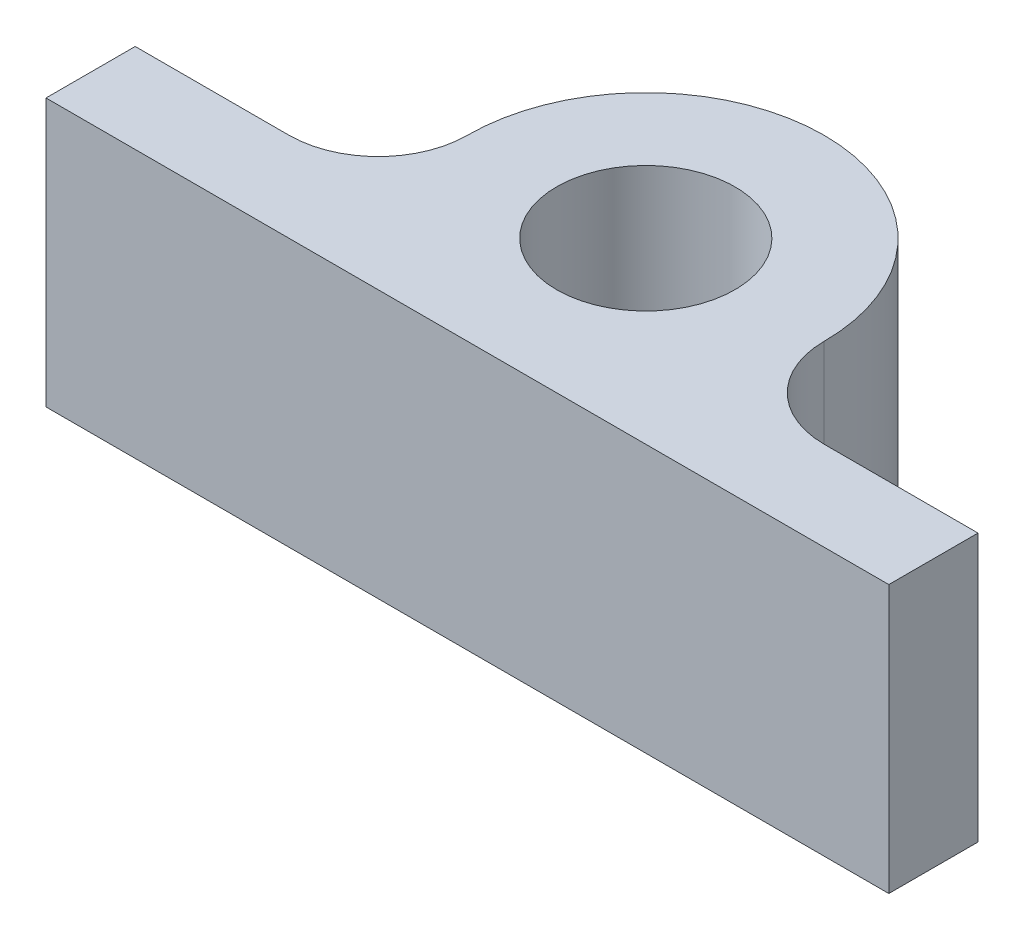
ISO-10303-21;
HEADER;
FILE_DESCRIPTION(('STEP AP214'),'2;1');
FILE_NAME('part.step','',(''),(''),'','','');
FILE_SCHEMA(('AUTOMOTIVE_DESIGN { 1 0 10303 214 1 1 1 1 }'));
ENDSEC;
DATA;
#1=APPLICATION_CONTEXT('core data for automotive mechanical design processes');
#2=APPLICATION_PROTOCOL_DEFINITION('international standard','automotive_design',2000,#1);
#3=PRODUCT_CONTEXT('',#1,'mechanical');
#4=PRODUCT('Part','Part','',(#3));
#5=PRODUCT_RELATED_PRODUCT_CATEGORY('part','',(#4));
#6=PRODUCT_DEFINITION_FORMATION('','',#4);
#7=PRODUCT_DEFINITION_CONTEXT('part definition',#1,'design');
#8=PRODUCT_DEFINITION('design','',#6,#7);
#9=PRODUCT_DEFINITION_SHAPE('','',#8);
#10=(LENGTH_UNIT() NAMED_UNIT(*) SI_UNIT(.MILLI.,.METRE.));
#11=(NAMED_UNIT(*) PLANE_ANGLE_UNIT() SI_UNIT($,.RADIAN.));
#12=(NAMED_UNIT(*) SI_UNIT($,.STERADIAN.) SOLID_ANGLE_UNIT());
#13=UNCERTAINTY_MEASURE_WITH_UNIT(LENGTH_MEASURE(1.E-05),#10,'distance_accuracy_value','');
#14=(GEOMETRIC_REPRESENTATION_CONTEXT(3) GLOBAL_UNCERTAINTY_ASSIGNED_CONTEXT((#13)) GLOBAL_UNIT_ASSIGNED_CONTEXT((#10,
#11,#12)) REPRESENTATION_CONTEXT('',''));
#15=CARTESIAN_POINT('',(0.,0.,0.));
#16=DIRECTION('',(0.,0.,1.));
#17=DIRECTION('',(1.,0.,0.));
#18=AXIS2_PLACEMENT_3D('',#15,#16,#17);
#19=CARTESIAN_POINT('',(38.1,38.1,0.));
#20=DIRECTION('',(0.,-1.,0.));
#21=DIRECTION('',(0.,0.,-1.));
#22=AXIS2_PLACEMENT_3D('',#19,#20,#21);
#23=CYLINDRICAL_SURFACE('',#22,12.7);
#24=CARTESIAN_POINT('',(38.1,0.,0.));
#25=DIRECTION('',(0.,1.,0.));
#26=DIRECTION('',(0.,0.,1.));
#27=AXIS2_PLACEMENT_3D('',#24,#25,#26);
#28=CIRCLE('',#27,12.7);
#29=CARTESIAN_POINT('',(25.4,0.,0.));
#30=VERTEX_POINT('',#29);
#31=CARTESIAN_POINT('',(38.1,0.,12.7));
#32=VERTEX_POINT('',#31);
#33=EDGE_CURVE('E154',#30,#32,#28,.T.);
#34=ORIENTED_EDGE('',*,*,#33,.F.);
#35=DIRECTION('',(0.,-1.,0.));
#36=VECTOR('',#35,1.);
#37=CARTESIAN_POINT('',(25.4,38.1,0.));
#38=LINE('',#37,#36);
#39=CARTESIAN_POINT('',(25.4,38.1,0.));
#40=VERTEX_POINT('',#39);
#41=EDGE_CURVE('E11',#40,#30,#38,.T.);
#42=ORIENTED_EDGE('',*,*,#41,.F.);
#43=CARTESIAN_POINT('',(38.1,38.1,0.));
#44=DIRECTION('',(0.,1.,0.));
#45=DIRECTION('',(0.,0.,1.));
#46=AXIS2_PLACEMENT_3D('',#43,#44,#45);
#47=CIRCLE('',#46,12.7);
#48=CARTESIAN_POINT('',(38.1,38.1,12.7));
#49=VERTEX_POINT('',#48);
#50=EDGE_CURVE('E208',#40,#49,#47,.T.);
#51=ORIENTED_EDGE('',*,*,#50,.T.);
#52=DIRECTION('',(0.,-1.,0.));
#53=VECTOR('',#52,1.);
#54=CARTESIAN_POINT('',(38.1,38.1,12.7));
#55=LINE('',#54,#53);
#56=EDGE_CURVE('E89',#49,#32,#55,.T.);
#57=ORIENTED_EDGE('',*,*,#56,.T.);
#58=EDGE_LOOP('',(#34,#42,#51,#57));
#59=FACE_BOUND('',#58,.T.);
#60=ADVANCED_FACE('F38',(#59),#23,.F.);
#61=CARTESIAN_POINT('',(0.,38.1,0.));
#62=DIRECTION('',(0.,-1.,0.));
#63=DIRECTION('',(0.,0.,-1.));
#64=AXIS2_PLACEMENT_3D('',#61,#62,#63);
#65=CYLINDRICAL_SURFACE('',#64,25.4);
#66=CARTESIAN_POINT('',(0.,0.,0.));
#67=DIRECTION('',(0.,1.,0.));
#68=DIRECTION('',(0.,0.,1.));
#69=AXIS2_PLACEMENT_3D('',#66,#67,#68);
#70=CIRCLE('',#69,25.4);
#71=CARTESIAN_POINT('',(-25.4,0.,0.));
#72=VERTEX_POINT('',#71);
#73=EDGE_CURVE('E152',#30,#72,#70,.T.);
#74=ORIENTED_EDGE('',*,*,#73,.T.);
#75=DIRECTION('',(0.,-1.,0.));
#76=VECTOR('',#75,1.);
#77=CARTESIAN_POINT('',(-25.4,38.1,0.));
#78=LINE('',#77,#76);
#79=CARTESIAN_POINT('',(-25.4,38.1,0.));
#80=VERTEX_POINT('',#79);
#81=EDGE_CURVE('E47',#80,#72,#78,.T.);
#82=ORIENTED_EDGE('',*,*,#81,.F.);
#83=CARTESIAN_POINT('',(0.,38.1,0.));
#84=DIRECTION('',(0.,1.,0.));
#85=DIRECTION('',(0.,0.,1.));
#86=AXIS2_PLACEMENT_3D('',#83,#84,#85);
#87=CIRCLE('',#86,25.4);
#88=EDGE_CURVE('E210',#40,#80,#87,.T.);
#89=ORIENTED_EDGE('',*,*,#88,.F.);
#90=ORIENTED_EDGE('',*,*,#41,.T.);
#91=EDGE_LOOP('',(#74,#82,#89,#90));
#92=FACE_BOUND('',#91,.T.);
#93=ADVANCED_FACE('F153',(#92),#65,.T.);
#94=CARTESIAN_POINT('',(-38.1,38.1,0.));
#95=DIRECTION('',(0.,-1.,0.));
#96=DIRECTION('',(0.,0.,-1.));
#97=AXIS2_PLACEMENT_3D('',#94,#95,#96);
#98=CYLINDRICAL_SURFACE('',#97,12.7);
#99=CARTESIAN_POINT('',(-38.1,0.,0.));
#100=DIRECTION('',(0.,1.,0.));
#101=DIRECTION('',(0.,0.,1.));
#102=AXIS2_PLACEMENT_3D('',#99,#100,#101);
#103=CIRCLE('',#102,12.7);
#104=CARTESIAN_POINT('',(-38.1,0.,12.7));
#105=VERTEX_POINT('',#104);
#106=EDGE_CURVE('E146',#105,#72,#103,.T.);
#107=ORIENTED_EDGE('',*,*,#106,.F.);
#108=DIRECTION('',(0.,-1.,0.));
#109=VECTOR('',#108,1.);
#110=CARTESIAN_POINT('',(-38.1,38.1,12.7));
#111=LINE('',#110,#109);
#112=CARTESIAN_POINT('',(-38.1,38.1,12.7));
#113=VERTEX_POINT('',#112);
#114=EDGE_CURVE('E138',#113,#105,#111,.T.);
#115=ORIENTED_EDGE('',*,*,#114,.F.);
#116=CARTESIAN_POINT('',(-38.1,38.1,0.));
#117=DIRECTION('',(0.,1.,0.));
#118=DIRECTION('',(0.,0.,1.));
#119=AXIS2_PLACEMENT_3D('',#116,#117,#118);
#120=CIRCLE('',#119,12.7);
#121=EDGE_CURVE('E149',#113,#80,#120,.T.);
#122=ORIENTED_EDGE('',*,*,#121,.T.);
#123=ORIENTED_EDGE('',*,*,#81,.T.);
#124=EDGE_LOOP('',(#107,#115,#122,#123));
#125=FACE_BOUND('',#124,.T.);
#126=ADVANCED_FACE('F144',(#125),#98,.F.);
#127=CARTESIAN_POINT('',(0.,38.1,12.7));
#128=DIRECTION('',(0.,0.,-1.));
#129=DIRECTION('',(-1.,0.,0.));
#130=AXIS2_PLACEMENT_3D('',#127,#128,#129);
#131=PLANE('',#130);
#132=DIRECTION('',(1.,0.,0.));
#133=VECTOR('',#132,1.);
#134=CARTESIAN_POINT('',(0.,0.,12.7));
#135=LINE('',#134,#133);
#136=CARTESIAN_POINT('',(-60.,0.,12.7));
#137=VERTEX_POINT('',#136);
#138=EDGE_CURVE('E159',#137,#105,#135,.T.);
#139=ORIENTED_EDGE('',*,*,#138,.F.);
#140=DIRECTION('',(0.,-1.,0.));
#141=VECTOR('',#140,1.);
#142=CARTESIAN_POINT('',(-60.,38.1,12.7));
#143=LINE('',#142,#141);
#144=CARTESIAN_POINT('',(-60.,38.1,12.7));
#145=VERTEX_POINT('',#144);
#146=EDGE_CURVE('E132',#145,#137,#143,.T.);
#147=ORIENTED_EDGE('',*,*,#146,.F.);
#148=DIRECTION('',(1.,0.,0.));
#149=VECTOR('',#148,1.);
#150=CARTESIAN_POINT('',(0.,38.1,12.7));
#151=LINE('',#150,#149);
#152=EDGE_CURVE('E215',#145,#113,#151,.T.);
#153=ORIENTED_EDGE('',*,*,#152,.T.);
#154=ORIENTED_EDGE('',*,*,#114,.T.);
#155=EDGE_LOOP('',(#139,#147,#153,#154));
#156=FACE_BOUND('',#155,.T.);
#157=ADVANCED_FACE('F182',(#156),#131,.T.);
#158=CARTESIAN_POINT('',(-60.,38.1,0.));
#159=DIRECTION('',(-1.,0.,0.));
#160=DIRECTION('',(0.,0.,1.));
#161=AXIS2_PLACEMENT_3D('',#158,#159,#160);
#162=PLANE('',#161);
#163=DIRECTION('',(0.,0.,-1.));
#164=VECTOR('',#163,1.);
#165=CARTESIAN_POINT('',(-60.,0.,0.));
#166=LINE('',#165,#164);
#167=CARTESIAN_POINT('',(-60.,0.,25.4));
#168=VERTEX_POINT('',#167);
#169=EDGE_CURVE('E161',#168,#137,#166,.T.);
#170=ORIENTED_EDGE('',*,*,#169,.F.);
#171=DIRECTION('',(0.,-1.,0.));
#172=VECTOR('',#171,1.);
#173=CARTESIAN_POINT('',(-60.,38.1,25.4));
#174=LINE('',#173,#172);
#175=CARTESIAN_POINT('',(-60.,38.1,25.4));
#176=VERTEX_POINT('',#175);
#177=EDGE_CURVE('E130',#176,#168,#174,.T.);
#178=ORIENTED_EDGE('',*,*,#177,.F.);
#179=DIRECTION('',(0.,0.,-1.));
#180=VECTOR('',#179,1.);
#181=CARTESIAN_POINT('',(-60.,38.1,0.));
#182=LINE('',#181,#180);
#183=EDGE_CURVE('E124',#176,#145,#182,.T.);
#184=ORIENTED_EDGE('',*,*,#183,.T.);
#185=ORIENTED_EDGE('',*,*,#146,.T.);
#186=EDGE_LOOP('',(#170,#178,#184,#185));
#187=FACE_BOUND('',#186,.T.);
#188=ADVANCED_FACE('F185',(#187),#162,.T.);
#189=CARTESIAN_POINT('',(0.,38.1,25.4));
#190=DIRECTION('',(0.,0.,-1.));
#191=DIRECTION('',(-1.,0.,0.));
#192=AXIS2_PLACEMENT_3D('',#189,#190,#191);
#193=PLANE('',#192);
#194=DIRECTION('',(1.,0.,0.));
#195=VECTOR('',#194,1.);
#196=CARTESIAN_POINT('',(0.,0.,25.4));
#197=LINE('',#196,#195);
#198=CARTESIAN_POINT('',(60.,0.,25.4));
#199=VERTEX_POINT('',#198);
#200=EDGE_CURVE('E129',#168,#199,#197,.T.);
#201=ORIENTED_EDGE('',*,*,#200,.T.);
#202=DIRECTION('',(0.,-1.,0.));
#203=VECTOR('',#202,1.);
#204=CARTESIAN_POINT('',(60.,38.1,25.4));
#205=LINE('',#204,#203);
#206=CARTESIAN_POINT('',(60.,38.1,25.4));
#207=VERTEX_POINT('',#206);
#208=EDGE_CURVE('E114',#207,#199,#205,.T.);
#209=ORIENTED_EDGE('',*,*,#208,.F.);
#210=DIRECTION('',(1.,0.,0.));
#211=VECTOR('',#210,1.);
#212=CARTESIAN_POINT('',(0.,38.1,25.4));
#213=LINE('',#212,#211);
#214=EDGE_CURVE('E117',#176,#207,#213,.T.);
#215=ORIENTED_EDGE('',*,*,#214,.F.);
#216=ORIENTED_EDGE('',*,*,#177,.T.);
#217=EDGE_LOOP('',(#201,#209,#215,#216));
#218=FACE_BOUND('',#217,.T.);
#219=ADVANCED_FACE('F127',(#218),#193,.F.);
#220=CARTESIAN_POINT('',(60.,38.1,0.));
#221=DIRECTION('',(-1.,0.,0.));
#222=DIRECTION('',(0.,0.,1.));
#223=AXIS2_PLACEMENT_3D('',#220,#221,#222);
#224=PLANE('',#223);
#225=DIRECTION('',(0.,0.,-1.));
#226=VECTOR('',#225,1.);
#227=CARTESIAN_POINT('',(60.,0.,0.));
#228=LINE('',#227,#226);
#229=CARTESIAN_POINT('',(60.,0.,12.7));
#230=VERTEX_POINT('',#229);
#231=EDGE_CURVE('E167',#199,#230,#228,.T.);
#232=ORIENTED_EDGE('',*,*,#231,.T.);
#233=DIRECTION('',(0.,-1.,0.));
#234=VECTOR('',#233,1.);
#235=CARTESIAN_POINT('',(60.,38.1,12.7));
#236=LINE('',#235,#234);
#237=CARTESIAN_POINT('',(60.,38.1,12.7));
#238=VERTEX_POINT('',#237);
#239=EDGE_CURVE('E116',#238,#230,#236,.T.);
#240=ORIENTED_EDGE('',*,*,#239,.F.);
#241=DIRECTION('',(0.,0.,-1.));
#242=VECTOR('',#241,1.);
#243=CARTESIAN_POINT('',(60.,38.1,0.));
#244=LINE('',#243,#242);
#245=EDGE_CURVE('E109',#207,#238,#244,.T.);
#246=ORIENTED_EDGE('',*,*,#245,.F.);
#247=ORIENTED_EDGE('',*,*,#208,.T.);
#248=EDGE_LOOP('',(#232,#240,#246,#247));
#249=FACE_BOUND('',#248,.T.);
#250=ADVANCED_FACE('F112',(#249),#224,.F.);
#251=CARTESIAN_POINT('',(0.,38.1,0.));
#252=DIRECTION('',(0.,-1.,0.));
#253=DIRECTION('',(0.,0.,-1.));
#254=AXIS2_PLACEMENT_3D('',#251,#252,#253);
#255=CYLINDRICAL_SURFACE('',#254,12.7);
#256=CARTESIAN_POINT('',(0.,38.1,0.));
#257=DIRECTION('',(0.,1.,0.));
#258=DIRECTION('',(0.,0.,1.));
#259=AXIS2_PLACEMENT_3D('',#256,#257,#258);
#260=CIRCLE('',#259,12.7);
#261=CARTESIAN_POINT('',(0.,38.1,12.7));
#262=VERTEX_POINT('',#261);
#263=EDGE_CURVE('E169',#262,#262,#260,.T.);
#264=ORIENTED_EDGE('',*,*,#263,.T.);
#265=EDGE_LOOP('',(#264));
#266=FACE_BOUND('',#265,.T.);
#267=CARTESIAN_POINT('',(0.,0.,0.));
#268=DIRECTION('',(0.,1.,0.));
#269=DIRECTION('',(0.,0.,1.));
#270=AXIS2_PLACEMENT_3D('',#267,#268,#269);
#271=CIRCLE('',#270,12.7);
#272=CARTESIAN_POINT('',(0.,0.,12.7));
#273=VERTEX_POINT('',#272);
#274=EDGE_CURVE('E172',#273,#273,#271,.T.);
#275=ORIENTED_EDGE('',*,*,#274,.F.);
#276=EDGE_LOOP('',(#275));
#277=FACE_BOUND('',#276,.T.);
#278=ADVANCED_FACE('F40',(#266,#277),#255,.F.);
#279=CARTESIAN_POINT('',(0.,38.1,12.7));
#280=DIRECTION('',(0.,0.,1.));
#281=DIRECTION('',(1.,0.,0.));
#282=AXIS2_PLACEMENT_3D('',#279,#280,#281);
#283=PLANE('',#282);
#284=DIRECTION('',(-1.,0.,0.));
#285=VECTOR('',#284,1.);
#286=CARTESIAN_POINT('',(0.,0.,12.7));
#287=LINE('',#286,#285);
#288=EDGE_CURVE('E82',#230,#32,#287,.T.);
#289=ORIENTED_EDGE('',*,*,#288,.T.);
#290=ORIENTED_EDGE('',*,*,#56,.F.);
#291=DIRECTION('',(-1.,0.,0.));
#292=VECTOR('',#291,1.);
#293=CARTESIAN_POINT('',(0.,38.1,12.7));
#294=LINE('',#293,#292);
#295=EDGE_CURVE('E55',#238,#49,#294,.T.);
#296=ORIENTED_EDGE('',*,*,#295,.F.);
#297=ORIENTED_EDGE('',*,*,#239,.T.);
#298=EDGE_LOOP('',(#289,#290,#296,#297));
#299=FACE_BOUND('',#298,.T.);
#300=ADVANCED_FACE('F194',(#299),#283,.F.);
#301=CARTESIAN_POINT('',(0.,38.1,0.));
#302=DIRECTION('',(0.,1.,0.));
#303=DIRECTION('',(0.,0.,1.));
#304=AXIS2_PLACEMENT_3D('',#301,#302,#303);
#305=PLANE('',#304);
#306=ORIENTED_EDGE('',*,*,#263,.F.);
#307=EDGE_LOOP('',(#306));
#308=FACE_BOUND('',#307,.T.);
#309=ORIENTED_EDGE('',*,*,#50,.F.);
#310=ORIENTED_EDGE('',*,*,#88,.T.);
#311=ORIENTED_EDGE('',*,*,#121,.F.);
#312=ORIENTED_EDGE('',*,*,#152,.F.);
#313=ORIENTED_EDGE('',*,*,#183,.F.);
#314=ORIENTED_EDGE('',*,*,#214,.T.);
#315=ORIENTED_EDGE('',*,*,#245,.T.);
#316=ORIENTED_EDGE('',*,*,#295,.T.);
#317=EDGE_LOOP('',(#309,#310,#311,#312,#313,#314,#315,#316));
#318=FACE_BOUND('',#317,.T.);
#319=ADVANCED_FACE('F121',(#308,#318),#305,.T.);
#320=CARTESIAN_POINT('',(0.,0.,0.));
#321=DIRECTION('',(0.,1.,0.));
#322=DIRECTION('',(0.,0.,1.));
#323=AXIS2_PLACEMENT_3D('',#320,#321,#322);
#324=PLANE('',#323);
#325=ORIENTED_EDGE('',*,*,#274,.T.);
#326=EDGE_LOOP('',(#325));
#327=FACE_BOUND('',#326,.T.);
#328=ORIENTED_EDGE('',*,*,#33,.T.);
#329=ORIENTED_EDGE('',*,*,#288,.F.);
#330=ORIENTED_EDGE('',*,*,#231,.F.);
#331=ORIENTED_EDGE('',*,*,#200,.F.);
#332=ORIENTED_EDGE('',*,*,#169,.T.);
#333=ORIENTED_EDGE('',*,*,#138,.T.);
#334=ORIENTED_EDGE('',*,*,#106,.T.);
#335=ORIENTED_EDGE('',*,*,#73,.F.);
#336=EDGE_LOOP('',(#328,#329,#330,#331,#332,#333,#334,#335));
#337=FACE_BOUND('',#336,.T.);
#338=ADVANCED_FACE('F156',(#327,#337),#324,.F.);
#339=CLOSED_SHELL('',(#60,#93,#126,#157,#188,#219,#250,#278,#300,#319,#338));
#340=MANIFOLD_SOLID_BREP('B2',#339);
#341=ADVANCED_BREP_SHAPE_REPRESENTATION('',(#18,#340),#14);
#342=SHAPE_DEFINITION_REPRESENTATION(#9,#341);
ENDSEC;
END-ISO-10303-21;
